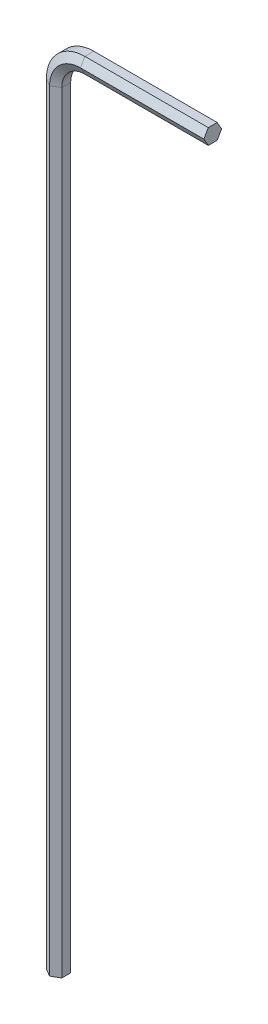
ISO-10303-21;
HEADER;
FILE_DESCRIPTION(('STEP AP214'),'2;1');
FILE_NAME('part.step','',(''),(''),'','','');
FILE_SCHEMA(('AUTOMOTIVE_DESIGN { 1 0 10303 214 1 1 1 1 }'));
ENDSEC;
DATA;
#1=APPLICATION_CONTEXT('core data for automotive mechanical design processes');
#2=APPLICATION_PROTOCOL_DEFINITION('international standard','automotive_design',2000,#1);
#3=PRODUCT_CONTEXT('',#1,'mechanical');
#4=PRODUCT('Part','Part','',(#3));
#5=PRODUCT_RELATED_PRODUCT_CATEGORY('part','',(#4));
#6=PRODUCT_DEFINITION_FORMATION('','',#4);
#7=PRODUCT_DEFINITION_CONTEXT('part definition',#1,'design');
#8=PRODUCT_DEFINITION('design','',#6,#7);
#9=PRODUCT_DEFINITION_SHAPE('','',#8);
#10=(LENGTH_UNIT() NAMED_UNIT(*) SI_UNIT(.MILLI.,.METRE.));
#11=(NAMED_UNIT(*) PLANE_ANGLE_UNIT() SI_UNIT($,.RADIAN.));
#12=(NAMED_UNIT(*) SI_UNIT($,.STERADIAN.) SOLID_ANGLE_UNIT());
#13=UNCERTAINTY_MEASURE_WITH_UNIT(LENGTH_MEASURE(1.E-05),#10,'distance_accuracy_value','');
#14=(GEOMETRIC_REPRESENTATION_CONTEXT(3) GLOBAL_UNCERTAINTY_ASSIGNED_CONTEXT((#13)) GLOBAL_UNIT_ASSIGNED_CONTEXT((#10,
#11,#12)) REPRESENTATION_CONTEXT('',''));
#15=CARTESIAN_POINT('',(0.,0.,0.));
#16=DIRECTION('',(0.,0.,1.));
#17=DIRECTION('',(1.,0.,0.));
#18=AXIS2_PLACEMENT_3D('',#15,#16,#17);
#19=CARTESIAN_POINT('',(-15.75,-3.,-0.43301270189222));
#20=DIRECTION('',(1.,0.,0.));
#21=DIRECTION('',(0.,0.,-1.));
#22=AXIS2_PLACEMENT_3D('',#19,#20,#21);
#23=PLANE('',#22);
#24=DIRECTION('',(0.,0.,1.));
#25=VECTOR('',#24,1.);
#26=CARTESIAN_POINT('',(-15.75,-3.,-0.43301270189222));
#27=LINE('',#26,#25);
#28=CARTESIAN_POINT('',(-15.75,-3.,-0.43301270189222));
#29=VERTEX_POINT('',#28);
#30=CARTESIAN_POINT('',(-15.75,-3.,0.433012701892219));
#31=VERTEX_POINT('',#30);
#32=EDGE_CURVE('E134',#29,#31,#27,.T.);
#33=ORIENTED_EDGE('',*,*,#32,.F.);
#34=DIRECTION('',(0.,-1.,0.));
#35=VECTOR('',#34,1.);
#36=CARTESIAN_POINT('',(-15.75,-3.,-0.43301270189222));
#37=LINE('',#36,#35);
#38=CARTESIAN_POINT('',(-15.75,-78.,-0.43301270189222));
#39=VERTEX_POINT('',#38);
#40=EDGE_CURVE('E39',#29,#39,#37,.T.);
#41=ORIENTED_EDGE('',*,*,#40,.T.);
#42=DIRECTION('',(0.,0.,1.));
#43=VECTOR('',#42,1.);
#44=CARTESIAN_POINT('',(-15.75,-78.,-0.43301270189222));
#45=LINE('',#44,#43);
#46=CARTESIAN_POINT('',(-15.75,-78.,0.433012701892219));
#47=VERTEX_POINT('',#46);
#48=EDGE_CURVE('E46',#39,#47,#45,.T.);
#49=ORIENTED_EDGE('',*,*,#48,.T.);
#50=DIRECTION('',(0.,-1.,0.));
#51=VECTOR('',#50,1.);
#52=CARTESIAN_POINT('',(-15.75,-3.,0.433012701892219));
#53=LINE('',#52,#51);
#54=EDGE_CURVE('E11',#31,#47,#53,.T.);
#55=ORIENTED_EDGE('',*,*,#54,.F.);
#56=EDGE_LOOP('',(#33,#41,#49,#55));
#57=FACE_BOUND('',#56,.T.);
#58=ADVANCED_FACE('F32',(#57),#23,.F.);
#59=CARTESIAN_POINT('',(-15.,-3.,-0.866025403784439));
#60=DIRECTION('',(0.5,0.,0.866025403784439));
#61=DIRECTION('',(0.866025403784439,0.,-0.5));
#62=AXIS2_PLACEMENT_3D('',#59,#60,#61);
#63=PLANE('',#62);
#64=DIRECTION('',(-0.866025403784439,0.,0.5));
#65=VECTOR('',#64,1.);
#66=CARTESIAN_POINT('',(-15.,-3.,-0.866025403784439));
#67=LINE('',#66,#65);
#68=CARTESIAN_POINT('',(-15.,-3.,-0.866025403784439));
#69=VERTEX_POINT('',#68);
#70=EDGE_CURVE('E202',#69,#29,#67,.T.);
#71=ORIENTED_EDGE('',*,*,#70,.F.);
#72=DIRECTION('',(0.,-1.,0.));
#73=VECTOR('',#72,1.);
#74=CARTESIAN_POINT('',(-15.,-3.,-0.866025403784439));
#75=LINE('',#74,#73);
#76=CARTESIAN_POINT('',(-15.,-78.,-0.866025403784439));
#77=VERTEX_POINT('',#76);
#78=EDGE_CURVE('E238',#69,#77,#75,.T.);
#79=ORIENTED_EDGE('',*,*,#78,.T.);
#80=DIRECTION('',(-0.866025403784439,0.,0.5));
#81=VECTOR('',#80,1.);
#82=CARTESIAN_POINT('',(-15.,-78.,-0.866025403784439));
#83=LINE('',#82,#81);
#84=EDGE_CURVE('E54',#77,#39,#83,.T.);
#85=ORIENTED_EDGE('',*,*,#84,.T.);
#86=ORIENTED_EDGE('',*,*,#40,.F.);
#87=EDGE_LOOP('',(#71,#79,#85,#86));
#88=FACE_BOUND('',#87,.T.);
#89=ADVANCED_FACE('F241',(#88),#63,.F.);
#90=CARTESIAN_POINT('',(-14.25,-3.,-0.43301270189222));
#91=DIRECTION('',(-0.5,0.,0.866025403784439));
#92=DIRECTION('',(0.866025403784439,0.,0.5));
#93=AXIS2_PLACEMENT_3D('',#90,#91,#92);
#94=PLANE('',#93);
#95=DIRECTION('',(-0.866025403784439,0.,-0.5));
#96=VECTOR('',#95,1.);
#97=CARTESIAN_POINT('',(-14.25,-3.,-0.43301270189222));
#98=LINE('',#97,#96);
#99=CARTESIAN_POINT('',(-14.25,-3.,-0.43301270189222));
#100=VERTEX_POINT('',#99);
#101=EDGE_CURVE('E199',#100,#69,#98,.T.);
#102=ORIENTED_EDGE('',*,*,#101,.F.);
#103=DIRECTION('',(0.,-1.,0.));
#104=VECTOR('',#103,1.);
#105=CARTESIAN_POINT('',(-14.25,-3.,-0.43301270189222));
#106=LINE('',#105,#104);
#107=CARTESIAN_POINT('',(-14.25,-78.,-0.43301270189222));
#108=VERTEX_POINT('',#107);
#109=EDGE_CURVE('E235',#100,#108,#106,.T.);
#110=ORIENTED_EDGE('',*,*,#109,.T.);
#111=DIRECTION('',(-0.866025403784439,0.,-0.5));
#112=VECTOR('',#111,1.);
#113=CARTESIAN_POINT('',(-14.25,-78.,-0.43301270189222));
#114=LINE('',#113,#112);
#115=EDGE_CURVE('E225',#108,#77,#114,.T.);
#116=ORIENTED_EDGE('',*,*,#115,.T.);
#117=ORIENTED_EDGE('',*,*,#78,.F.);
#118=EDGE_LOOP('',(#102,#110,#116,#117));
#119=FACE_BOUND('',#118,.T.);
#120=ADVANCED_FACE('F276',(#119),#94,.F.);
#121=CARTESIAN_POINT('',(-14.25,-3.,0.43301270189222));
#122=DIRECTION('',(-1.,0.,0.));
#123=DIRECTION('',(0.,0.,1.));
#124=AXIS2_PLACEMENT_3D('',#121,#122,#123);
#125=PLANE('',#124);
#126=DIRECTION('',(0.,0.,-1.));
#127=VECTOR('',#126,1.);
#128=CARTESIAN_POINT('',(-14.25,-3.,0.43301270189222));
#129=LINE('',#128,#127);
#130=CARTESIAN_POINT('',(-14.25,-3.,0.43301270189222));
#131=VERTEX_POINT('',#130);
#132=EDGE_CURVE('E196',#131,#100,#129,.T.);
#133=ORIENTED_EDGE('',*,*,#132,.F.);
#134=DIRECTION('',(0.,-1.,0.));
#135=VECTOR('',#134,1.);
#136=CARTESIAN_POINT('',(-14.25,-3.,0.43301270189222));
#137=LINE('',#136,#135);
#138=CARTESIAN_POINT('',(-14.25,-78.,0.43301270189222));
#139=VERTEX_POINT('',#138);
#140=EDGE_CURVE('E232',#131,#139,#137,.T.);
#141=ORIENTED_EDGE('',*,*,#140,.T.);
#142=DIRECTION('',(0.,0.,-1.));
#143=VECTOR('',#142,1.);
#144=CARTESIAN_POINT('',(-14.25,-78.,0.43301270189222));
#145=LINE('',#144,#143);
#146=EDGE_CURVE('E223',#139,#108,#145,.T.);
#147=ORIENTED_EDGE('',*,*,#146,.T.);
#148=ORIENTED_EDGE('',*,*,#109,.F.);
#149=EDGE_LOOP('',(#133,#141,#147,#148));
#150=FACE_BOUND('',#149,.T.);
#151=ADVANCED_FACE('F267',(#150),#125,.F.);
#152=CARTESIAN_POINT('',(-15.,-3.,0.866025403784439));
#153=DIRECTION('',(-0.5,0.,-0.866025403784439));
#154=DIRECTION('',(-0.866025403784439,0.,0.5));
#155=AXIS2_PLACEMENT_3D('',#152,#153,#154);
#156=PLANE('',#155);
#157=DIRECTION('',(0.866025403784439,0.,-0.5));
#158=VECTOR('',#157,1.);
#159=CARTESIAN_POINT('',(-15.,-3.,0.866025403784439));
#160=LINE('',#159,#158);
#161=CARTESIAN_POINT('',(-15.,-3.,0.866025403784439));
#162=VERTEX_POINT('',#161);
#163=EDGE_CURVE('E194',#162,#131,#160,.T.);
#164=ORIENTED_EDGE('',*,*,#163,.F.);
#165=DIRECTION('',(0.,-1.,0.));
#166=VECTOR('',#165,1.);
#167=CARTESIAN_POINT('',(-15.,-3.,0.866025403784439));
#168=LINE('',#167,#166);
#169=CARTESIAN_POINT('',(-15.,-78.,0.866025403784439));
#170=VERTEX_POINT('',#169);
#171=EDGE_CURVE('E229',#162,#170,#168,.T.);
#172=ORIENTED_EDGE('',*,*,#171,.T.);
#173=DIRECTION('',(0.866025403784439,0.,-0.5));
#174=VECTOR('',#173,1.);
#175=CARTESIAN_POINT('',(-15.,-78.,0.866025403784439));
#176=LINE('',#175,#174);
#177=EDGE_CURVE('E221',#170,#139,#176,.T.);
#178=ORIENTED_EDGE('',*,*,#177,.T.);
#179=ORIENTED_EDGE('',*,*,#140,.F.);
#180=EDGE_LOOP('',(#164,#172,#178,#179));
#181=FACE_BOUND('',#180,.T.);
#182=ADVANCED_FACE('F270',(#181),#156,.F.);
#183=CARTESIAN_POINT('',(-15.75,-3.,0.433012701892219));
#184=DIRECTION('',(0.5,0.,-0.866025403784439));
#185=DIRECTION('',(-0.866025403784439,0.,-0.5));
#186=AXIS2_PLACEMENT_3D('',#183,#184,#185);
#187=PLANE('',#186);
#188=DIRECTION('',(0.866025403784439,0.,0.5));
#189=VECTOR('',#188,1.);
#190=CARTESIAN_POINT('',(-15.75,-3.,0.433012701892219));
#191=LINE('',#190,#189);
#192=EDGE_CURVE('E130',#31,#162,#191,.T.);
#193=ORIENTED_EDGE('',*,*,#192,.F.);
#194=ORIENTED_EDGE('',*,*,#54,.T.);
#195=DIRECTION('',(0.866025403784439,0.,0.5));
#196=VECTOR('',#195,1.);
#197=CARTESIAN_POINT('',(-15.75,-78.,0.433012701892219));
#198=LINE('',#197,#196);
#199=EDGE_CURVE('E219',#47,#170,#198,.T.);
#200=ORIENTED_EDGE('',*,*,#199,.T.);
#201=ORIENTED_EDGE('',*,*,#171,.F.);
#202=EDGE_LOOP('',(#193,#194,#200,#201));
#203=FACE_BOUND('',#202,.T.);
#204=ADVANCED_FACE('F310',(#203),#187,.F.);
#205=CARTESIAN_POINT('',(-12.,-3.,0.));
#206=DIRECTION('',(0.,0.,1.));
#207=DIRECTION('',(1.,0.,0.));
#208=AXIS2_PLACEMENT_3D('',#205,#206,#207);
#209=CYLINDRICAL_SURFACE('',#208,3.75);
#210=DIRECTION('',(0.,0.,1.));
#211=VECTOR('',#210,1.);
#212=CARTESIAN_POINT('',(-12.,0.749999999999999,-0.43301270189222));
#213=LINE('',#212,#211);
#214=CARTESIAN_POINT('',(-12.,0.749999999999999,-0.43301270189222));
#215=VERTEX_POINT('',#214);
#216=CARTESIAN_POINT('',(-12.,0.749999999999999,0.433012701892219));
#217=VERTEX_POINT('',#216);
#218=EDGE_CURVE('E154',#215,#217,#213,.T.);
#219=ORIENTED_EDGE('',*,*,#218,.F.);
#220=CARTESIAN_POINT('',(-12.,-3.,-0.43301270189222));
#221=DIRECTION('',(0.,0.,1.));
#222=DIRECTION('',(1.,0.,0.));
#223=AXIS2_PLACEMENT_3D('',#220,#221,#222);
#224=CIRCLE('',#223,3.75);
#225=EDGE_CURVE('E214',#215,#29,#224,.T.);
#226=ORIENTED_EDGE('',*,*,#225,.T.);
#227=ORIENTED_EDGE('',*,*,#32,.T.);
#228=CARTESIAN_POINT('',(-12.,-3.,0.433012701892219));
#229=DIRECTION('',(0.,0.,1.));
#230=DIRECTION('',(1.,0.,0.));
#231=AXIS2_PLACEMENT_3D('',#228,#229,#230);
#232=CIRCLE('',#231,3.75);
#233=EDGE_CURVE('E217',#217,#31,#232,.T.);
#234=ORIENTED_EDGE('',*,*,#233,.F.);
#235=EDGE_LOOP('',(#219,#226,#227,#234));
#236=FACE_BOUND('',#235,.T.);
#237=ADVANCED_FACE('F319',(#236),#209,.T.);
#238=CARTESIAN_POINT('',(-12.,-3.,-0.866025403784439));
#239=DIRECTION('',(0.,0.,1.));
#240=DIRECTION('',(1.,0.,0.));
#241=AXIS2_PLACEMENT_3D('',#238,#239,#240);
#242=CONICAL_SURFACE('',#241,3.,1.0471975511966);
#243=DIRECTION('',(0.,0.866025403784439,0.5));
#244=VECTOR('',#243,1.);
#245=CARTESIAN_POINT('',(-12.,0.,-0.866025403784439));
#246=LINE('',#245,#244);
#247=CARTESIAN_POINT('',(-12.,0.,-0.866025403784439));
#248=VERTEX_POINT('',#247);
#249=EDGE_CURVE('E170',#248,#215,#246,.T.);
#250=ORIENTED_EDGE('',*,*,#249,.F.);
#251=CARTESIAN_POINT('',(-12.,-3.,-0.866025403784439));
#252=DIRECTION('',(0.,0.,1.));
#253=DIRECTION('',(1.,0.,0.));
#254=AXIS2_PLACEMENT_3D('',#251,#252,#253);
#255=CIRCLE('',#254,3.);
#256=EDGE_CURVE('E211',#248,#69,#255,.T.);
#257=ORIENTED_EDGE('',*,*,#256,.T.);
#258=ORIENTED_EDGE('',*,*,#70,.T.);
#259=ORIENTED_EDGE('',*,*,#225,.F.);
#260=EDGE_LOOP('',(#250,#257,#258,#259));
#261=FACE_BOUND('',#260,.T.);
#262=ADVANCED_FACE('F249',(#261),#242,.T.);
#263=CARTESIAN_POINT('',(-12.,-3.,-0.43301270189222));
#264=DIRECTION('',(0.,0.,-1.));
#265=DIRECTION('',(-1.,0.,0.));
#266=AXIS2_PLACEMENT_3D('',#263,#264,#265);
#267=CONICAL_SURFACE('',#266,2.25,1.0471975511966);
#268=DIRECTION('',(0.,0.866025403784439,-0.5));
#269=VECTOR('',#268,1.);
#270=CARTESIAN_POINT('',(-12.,-0.750000000000001,-0.43301270189222));
#271=LINE('',#270,#269);
#272=CARTESIAN_POINT('',(-12.,-0.750000000000001,-0.43301270189222));
#273=VERTEX_POINT('',#272);
#274=EDGE_CURVE('E167',#273,#248,#271,.T.);
#275=ORIENTED_EDGE('',*,*,#274,.F.);
#276=CARTESIAN_POINT('',(-12.,-3.,-0.43301270189222));
#277=DIRECTION('',(0.,0.,1.));
#278=DIRECTION('',(1.,0.,0.));
#279=AXIS2_PLACEMENT_3D('',#276,#277,#278);
#280=CIRCLE('',#279,2.25);
#281=EDGE_CURVE('E208',#273,#100,#280,.T.);
#282=ORIENTED_EDGE('',*,*,#281,.T.);
#283=ORIENTED_EDGE('',*,*,#101,.T.);
#284=ORIENTED_EDGE('',*,*,#256,.F.);
#285=EDGE_LOOP('',(#275,#282,#283,#284));
#286=FACE_BOUND('',#285,.T.);
#287=ADVANCED_FACE('F246',(#286),#267,.F.);
#288=CARTESIAN_POINT('',(-12.,-3.,0.));
#289=DIRECTION('',(0.,0.,1.));
#290=DIRECTION('',(1.,0.,0.));
#291=AXIS2_PLACEMENT_3D('',#288,#289,#290);
#292=CYLINDRICAL_SURFACE('',#291,2.25);
#293=DIRECTION('',(0.,0.,-1.));
#294=VECTOR('',#293,1.);
#295=CARTESIAN_POINT('',(-12.,-0.750000000000001,0.43301270189222));
#296=LINE('',#295,#294);
#297=CARTESIAN_POINT('',(-12.,-0.750000000000001,0.43301270189222));
#298=VERTEX_POINT('',#297);
#299=EDGE_CURVE('E143',#298,#273,#296,.T.);
#300=ORIENTED_EDGE('',*,*,#299,.F.);
#301=CARTESIAN_POINT('',(-12.,-3.,0.43301270189222));
#302=DIRECTION('',(0.,0.,1.));
#303=DIRECTION('',(1.,0.,0.));
#304=AXIS2_PLACEMENT_3D('',#301,#302,#303);
#305=CIRCLE('',#304,2.25);
#306=EDGE_CURVE('E133',#298,#131,#305,.T.);
#307=ORIENTED_EDGE('',*,*,#306,.T.);
#308=ORIENTED_EDGE('',*,*,#132,.T.);
#309=ORIENTED_EDGE('',*,*,#281,.F.);
#310=EDGE_LOOP('',(#300,#307,#308,#309));
#311=FACE_BOUND('',#310,.T.);
#312=ADVANCED_FACE('F264',(#311),#292,.F.);
#313=CARTESIAN_POINT('',(-12.,-3.,0.866025403784439));
#314=DIRECTION('',(0.,0.,1.));
#315=DIRECTION('',(1.,0.,0.));
#316=AXIS2_PLACEMENT_3D('',#313,#314,#315);
#317=CONICAL_SURFACE('',#316,3.,1.0471975511966);
#318=DIRECTION('',(0.,-0.866025403784439,-0.5));
#319=VECTOR('',#318,1.);
#320=CARTESIAN_POINT('',(-12.,0.,0.866025403784439));
#321=LINE('',#320,#319);
#322=CARTESIAN_POINT('',(-12.,0.,0.866025403784439));
#323=VERTEX_POINT('',#322);
#324=EDGE_CURVE('E137',#323,#298,#321,.T.);
#325=ORIENTED_EDGE('',*,*,#324,.F.);
#326=CARTESIAN_POINT('',(-12.,-3.,0.866025403784439));
#327=DIRECTION('',(0.,0.,1.));
#328=DIRECTION('',(1.,0.,0.));
#329=AXIS2_PLACEMENT_3D('',#326,#327,#328);
#330=CIRCLE('',#329,3.);
#331=EDGE_CURVE('E122',#323,#162,#330,.T.);
#332=ORIENTED_EDGE('',*,*,#331,.T.);
#333=ORIENTED_EDGE('',*,*,#163,.T.);
#334=ORIENTED_EDGE('',*,*,#306,.F.);
#335=EDGE_LOOP('',(#325,#332,#333,#334));
#336=FACE_BOUND('',#335,.T.);
#337=ADVANCED_FACE('F139',(#336),#317,.F.);
#338=CARTESIAN_POINT('',(-12.,-3.,0.433012701892219));
#339=DIRECTION('',(0.,0.,-1.));
#340=DIRECTION('',(-1.,0.,0.));
#341=AXIS2_PLACEMENT_3D('',#338,#339,#340);
#342=CONICAL_SURFACE('',#341,3.75,1.0471975511966);
#343=DIRECTION('',(0.,-0.866025403784439,0.5));
#344=VECTOR('',#343,1.);
#345=CARTESIAN_POINT('',(-12.,0.749999999999999,0.433012701892219));
#346=LINE('',#345,#344);
#347=EDGE_CURVE('E127',#217,#323,#346,.T.);
#348=ORIENTED_EDGE('',*,*,#347,.F.);
#349=ORIENTED_EDGE('',*,*,#233,.T.);
#350=ORIENTED_EDGE('',*,*,#192,.T.);
#351=ORIENTED_EDGE('',*,*,#331,.F.);
#352=EDGE_LOOP('',(#348,#349,#350,#351));
#353=FACE_BOUND('',#352,.T.);
#354=ADVANCED_FACE('F124',(#353),#342,.T.);
#355=CARTESIAN_POINT('',(-12.,0.749999999999999,0.433012701892219));
#356=DIRECTION('',(0.,0.5,0.866025403784439));
#357=DIRECTION('',(0.,-0.866025403784439,0.5));
#358=AXIS2_PLACEMENT_3D('',#355,#356,#357);
#359=PLANE('',#358);
#360=DIRECTION('',(0.,-0.866025403784439,0.5));
#361=VECTOR('',#360,1.);
#362=CARTESIAN_POINT('',(0.,0.75,0.433012701892219));
#363=LINE('',#362,#361);
#364=CARTESIAN_POINT('',(0.,0.75,0.433012701892219));
#365=VERTEX_POINT('',#364);
#366=CARTESIAN_POINT('',(0.,0.,0.866025403784439));
#367=VERTEX_POINT('',#366);
#368=EDGE_CURVE('E174',#365,#367,#363,.T.);
#369=ORIENTED_EDGE('',*,*,#368,.F.);
#370=DIRECTION('',(1.,0.,0.));
#371=VECTOR('',#370,1.);
#372=CARTESIAN_POINT('',(-12.,0.749999999999999,0.433012701892219));
#373=LINE('',#372,#371);
#374=EDGE_CURVE('E157',#217,#365,#373,.T.);
#375=ORIENTED_EDGE('',*,*,#374,.F.);
#376=ORIENTED_EDGE('',*,*,#347,.T.);
#377=DIRECTION('',(1.,0.,0.));
#378=VECTOR('',#377,1.);
#379=CARTESIAN_POINT('',(-12.,0.,0.866025403784439));
#380=LINE('',#379,#378);
#381=EDGE_CURVE('E146',#323,#367,#380,.T.);
#382=ORIENTED_EDGE('',*,*,#381,.T.);
#383=EDGE_LOOP('',(#369,#375,#376,#382));
#384=FACE_BOUND('',#383,.T.);
#385=ADVANCED_FACE('F156',(#384),#359,.T.);
#386=CARTESIAN_POINT('',(-12.,0.749999999999999,-0.43301270189222));
#387=DIRECTION('',(0.,1.,0.));
#388=DIRECTION('',(0.,0.,1.));
#389=AXIS2_PLACEMENT_3D('',#386,#387,#388);
#390=PLANE('',#389);
#391=DIRECTION('',(0.,0.,1.));
#392=VECTOR('',#391,1.);
#393=CARTESIAN_POINT('',(0.,0.75,-0.43301270189222));
#394=LINE('',#393,#392);
#395=CARTESIAN_POINT('',(0.,0.75,-0.43301270189222));
#396=VERTEX_POINT('',#395);
#397=EDGE_CURVE('E159',#396,#365,#394,.T.);
#398=ORIENTED_EDGE('',*,*,#397,.F.);
#399=DIRECTION('',(1.,0.,0.));
#400=VECTOR('',#399,1.);
#401=CARTESIAN_POINT('',(-12.,0.749999999999999,-0.43301270189222));
#402=LINE('',#401,#400);
#403=EDGE_CURVE('E186',#215,#396,#402,.T.);
#404=ORIENTED_EDGE('',*,*,#403,.F.);
#405=ORIENTED_EDGE('',*,*,#218,.T.);
#406=ORIENTED_EDGE('',*,*,#374,.T.);
#407=EDGE_LOOP('',(#398,#404,#405,#406));
#408=FACE_BOUND('',#407,.T.);
#409=ADVANCED_FACE('F378',(#408),#390,.T.);
#410=CARTESIAN_POINT('',(-12.,0.,-0.866025403784439));
#411=DIRECTION('',(0.,0.5,-0.866025403784439));
#412=DIRECTION('',(0.,0.866025403784439,0.5));
#413=AXIS2_PLACEMENT_3D('',#410,#411,#412);
#414=PLANE('',#413);
#415=DIRECTION('',(0.,0.866025403784439,0.5));
#416=VECTOR('',#415,1.);
#417=CARTESIAN_POINT('',(0.,0.,-0.866025403784439));
#418=LINE('',#417,#416);
#419=CARTESIAN_POINT('',(0.,0.,-0.866025403784439));
#420=VERTEX_POINT('',#419);
#421=EDGE_CURVE('E162',#420,#396,#418,.T.);
#422=ORIENTED_EDGE('',*,*,#421,.F.);
#423=DIRECTION('',(1.,0.,0.));
#424=VECTOR('',#423,1.);
#425=CARTESIAN_POINT('',(-12.,0.,-0.866025403784439));
#426=LINE('',#425,#424);
#427=EDGE_CURVE('E188',#248,#420,#426,.T.);
#428=ORIENTED_EDGE('',*,*,#427,.F.);
#429=ORIENTED_EDGE('',*,*,#249,.T.);
#430=ORIENTED_EDGE('',*,*,#403,.T.);
#431=EDGE_LOOP('',(#422,#428,#429,#430));
#432=FACE_BOUND('',#431,.T.);
#433=ADVANCED_FACE('F254',(#432),#414,.T.);
#434=CARTESIAN_POINT('',(-12.,-0.750000000000001,-0.43301270189222));
#435=DIRECTION('',(0.,-0.5,-0.866025403784439));
#436=DIRECTION('',(0.,0.866025403784439,-0.5));
#437=AXIS2_PLACEMENT_3D('',#434,#435,#436);
#438=PLANE('',#437);
#439=DIRECTION('',(0.,0.866025403784439,-0.5));
#440=VECTOR('',#439,1.);
#441=CARTESIAN_POINT('',(0.,-0.75,-0.43301270189222));
#442=LINE('',#441,#440);
#443=CARTESIAN_POINT('',(0.,-0.75,-0.43301270189222));
#444=VERTEX_POINT('',#443);
#445=EDGE_CURVE('E180',#444,#420,#442,.T.);
#446=ORIENTED_EDGE('',*,*,#445,.F.);
#447=DIRECTION('',(1.,0.,0.));
#448=VECTOR('',#447,1.);
#449=CARTESIAN_POINT('',(-12.,-0.750000000000001,-0.43301270189222));
#450=LINE('',#449,#448);
#451=EDGE_CURVE('E190',#273,#444,#450,.T.);
#452=ORIENTED_EDGE('',*,*,#451,.F.);
#453=ORIENTED_EDGE('',*,*,#274,.T.);
#454=ORIENTED_EDGE('',*,*,#427,.T.);
#455=EDGE_LOOP('',(#446,#452,#453,#454));
#456=FACE_BOUND('',#455,.T.);
#457=ADVANCED_FACE('F258',(#456),#438,.T.);
#458=CARTESIAN_POINT('',(-12.,-0.750000000000001,0.43301270189222));
#459=DIRECTION('',(0.,-1.,0.));
#460=DIRECTION('',(0.,0.,-1.));
#461=AXIS2_PLACEMENT_3D('',#458,#459,#460);
#462=PLANE('',#461);
#463=DIRECTION('',(0.,0.,-1.));
#464=VECTOR('',#463,1.);
#465=CARTESIAN_POINT('',(0.,-0.75,0.43301270189222));
#466=LINE('',#465,#464);
#467=CARTESIAN_POINT('',(0.,-0.75,0.43301270189222));
#468=VERTEX_POINT('',#467);
#469=EDGE_CURVE('E177',#468,#444,#466,.T.);
#470=ORIENTED_EDGE('',*,*,#469,.F.);
#471=DIRECTION('',(1.,0.,0.));
#472=VECTOR('',#471,1.);
#473=CARTESIAN_POINT('',(-12.,-0.750000000000001,0.43301270189222));
#474=LINE('',#473,#472);
#475=EDGE_CURVE('E153',#298,#468,#474,.T.);
#476=ORIENTED_EDGE('',*,*,#475,.F.);
#477=ORIENTED_EDGE('',*,*,#299,.T.);
#478=ORIENTED_EDGE('',*,*,#451,.T.);
#479=EDGE_LOOP('',(#470,#476,#477,#478));
#480=FACE_BOUND('',#479,.T.);
#481=ADVANCED_FACE('F262',(#480),#462,.T.);
#482=CARTESIAN_POINT('',(-12.,0.,0.866025403784439));
#483=DIRECTION('',(0.,-0.5,0.866025403784439));
#484=DIRECTION('',(0.,-0.866025403784439,-0.5));
#485=AXIS2_PLACEMENT_3D('',#482,#483,#484);
#486=PLANE('',#485);
#487=DIRECTION('',(0.,-0.866025403784439,-0.5));
#488=VECTOR('',#487,1.);
#489=CARTESIAN_POINT('',(0.,0.,0.866025403784439));
#490=LINE('',#489,#488);
#491=EDGE_CURVE('E149',#367,#468,#490,.T.);
#492=ORIENTED_EDGE('',*,*,#491,.F.);
#493=ORIENTED_EDGE('',*,*,#381,.F.);
#494=ORIENTED_EDGE('',*,*,#324,.T.);
#495=ORIENTED_EDGE('',*,*,#475,.T.);
#496=EDGE_LOOP('',(#492,#493,#494,#495));
#497=FACE_BOUND('',#496,.T.);
#498=ADVANCED_FACE('F147',(#497),#486,.T.);
#499=CARTESIAN_POINT('',(-15.75,-78.,0.433012701892219));
#500=DIRECTION('',(0.,-1.,0.));
#501=DIRECTION('',(0.,0.,1.));
#502=AXIS2_PLACEMENT_3D('',#499,#500,#501);
#503=PLANE('',#502);
#504=ORIENTED_EDGE('',*,*,#199,.F.);
#505=ORIENTED_EDGE('',*,*,#48,.F.);
#506=ORIENTED_EDGE('',*,*,#84,.F.);
#507=ORIENTED_EDGE('',*,*,#115,.F.);
#508=ORIENTED_EDGE('',*,*,#146,.F.);
#509=ORIENTED_EDGE('',*,*,#177,.F.);
#510=EDGE_LOOP('',(#504,#505,#506,#507,#508,#509));
#511=FACE_BOUND('',#510,.T.);
#512=ADVANCED_FACE('F275',(#511),#503,.T.);
#513=CARTESIAN_POINT('',(0.,0.75,0.433012701892219));
#514=DIRECTION('',(-1.,0.,0.));
#515=DIRECTION('',(0.,0.,1.));
#516=AXIS2_PLACEMENT_3D('',#513,#514,#515);
#517=PLANE('',#516);
#518=ORIENTED_EDGE('',*,*,#368,.T.);
#519=ORIENTED_EDGE('',*,*,#491,.T.);
#520=ORIENTED_EDGE('',*,*,#469,.T.);
#521=ORIENTED_EDGE('',*,*,#445,.T.);
#522=ORIENTED_EDGE('',*,*,#421,.T.);
#523=ORIENTED_EDGE('',*,*,#397,.T.);
#524=EDGE_LOOP('',(#518,#519,#520,#521,#522,#523));
#525=FACE_BOUND('',#524,.T.);
#526=ADVANCED_FACE('F428',(#525),#517,.F.);
#527=CLOSED_SHELL('',(#58,#89,#120,#151,#182,#204,#237,#262,#287,#312,#337,#354,#385,#409,#433,
#457,#481,#498,#512,#526));
#528=MANIFOLD_SOLID_BREP('B2',#527);
#529=ADVANCED_BREP_SHAPE_REPRESENTATION('',(#18,#528),#14);
#530=SHAPE_DEFINITION_REPRESENTATION(#9,#529);
ENDSEC;
END-ISO-10303-21;
